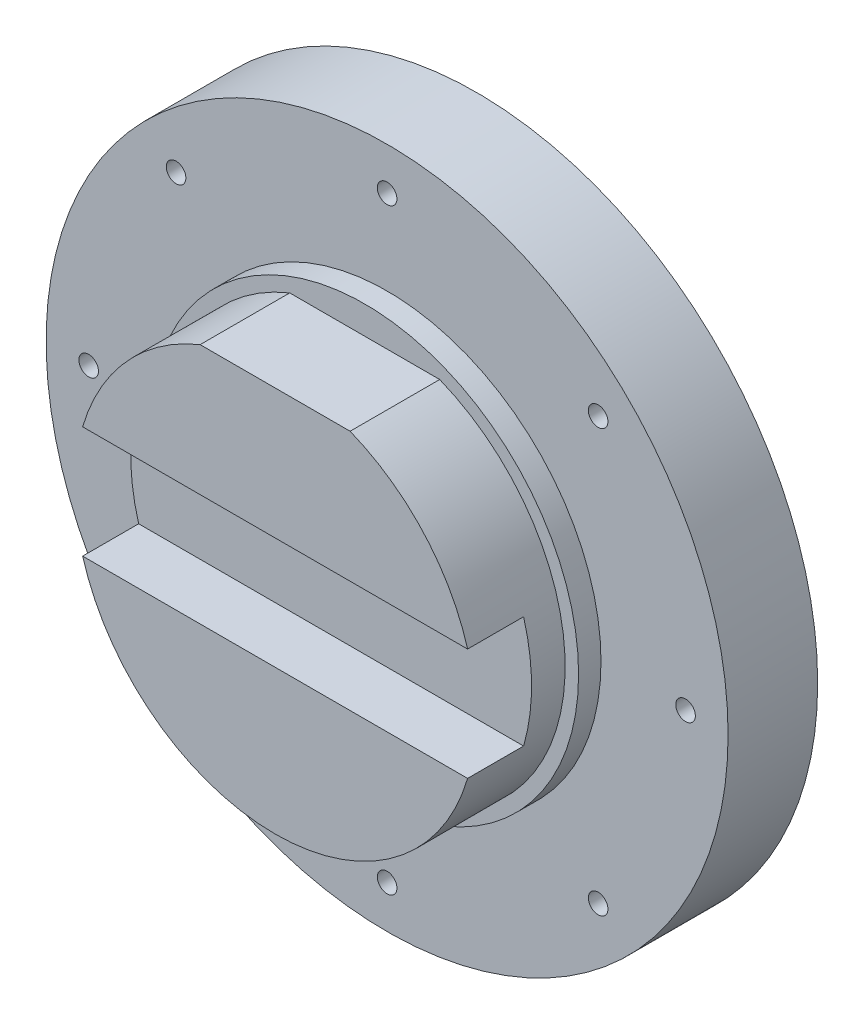
ISO-10303-21;
HEADER;
FILE_DESCRIPTION(('STEP AP214'),'2;1');
FILE_NAME('part.step','',(''),(''),'','','');
FILE_SCHEMA(('AUTOMOTIVE_DESIGN { 1 0 10303 214 1 1 1 1 }'));
ENDSEC;
DATA;
#1=APPLICATION_CONTEXT('core data for automotive mechanical design processes');
#2=APPLICATION_PROTOCOL_DEFINITION('international standard','automotive_design',2000,#1);
#3=PRODUCT_CONTEXT('',#1,'mechanical');
#4=PRODUCT('Part','Part','',(#3));
#5=PRODUCT_RELATED_PRODUCT_CATEGORY('part','',(#4));
#6=PRODUCT_DEFINITION_FORMATION('','',#4);
#7=PRODUCT_DEFINITION_CONTEXT('part definition',#1,'design');
#8=PRODUCT_DEFINITION('design','',#6,#7);
#9=PRODUCT_DEFINITION_SHAPE('','',#8);
#10=(LENGTH_UNIT() NAMED_UNIT(*) SI_UNIT(.MILLI.,.METRE.));
#11=(NAMED_UNIT(*) PLANE_ANGLE_UNIT() SI_UNIT($,.RADIAN.));
#12=(NAMED_UNIT(*) SI_UNIT($,.STERADIAN.) SOLID_ANGLE_UNIT());
#13=UNCERTAINTY_MEASURE_WITH_UNIT(LENGTH_MEASURE(1.E-05),#10,'distance_accuracy_value','');
#14=(GEOMETRIC_REPRESENTATION_CONTEXT(3) GLOBAL_UNCERTAINTY_ASSIGNED_CONTEXT((#13)) GLOBAL_UNIT_ASSIGNED_CONTEXT((#10,
#11,#12)) REPRESENTATION_CONTEXT('',''));
#15=CARTESIAN_POINT('',(0.,0.,0.));
#16=DIRECTION('',(0.,0.,1.));
#17=DIRECTION('',(1.,0.,0.));
#18=AXIS2_PLACEMENT_3D('',#15,#16,#17);
#19=CARTESIAN_POINT('',(0.,0.,180.));
#20=DIRECTION('',(0.,0.,1.));
#21=DIRECTION('',(1.,0.,0.));
#22=AXIS2_PLACEMENT_3D('',#19,#20,#21);
#23=PLANE('',#22);
#24=DIRECTION('',(1.,0.,0.));
#25=VECTOR('',#24,1.);
#26=CARTESIAN_POINT('',(0.,-50.,180.));
#27=LINE('',#26,#25);
#28=CARTESIAN_POINT('',(-171.874954545449,-50.,180.));
#29=VERTEX_POINT('',#28);
#30=CARTESIAN_POINT('',(171.874954545448,-50.,180.));
#31=VERTEX_POINT('',#30);
#32=EDGE_CURVE('E135',#29,#31,#27,.T.);
#33=ORIENTED_EDGE('',*,*,#32,.F.);
#34=CARTESIAN_POINT('',(0.,0.,180.));
#35=DIRECTION('',(0.,0.,1.));
#36=DIRECTION('',(1.,0.,0.));
#37=AXIS2_PLACEMENT_3D('',#34,#35,#36);
#38=CIRCLE('',#37,179.);
#39=EDGE_CURVE('E166',#29,#31,#38,.T.);
#40=ORIENTED_EDGE('',*,*,#39,.T.);
#41=EDGE_LOOP('',(#33,#40));
#42=FACE_BOUND('',#41,.T.);
#43=ADVANCED_FACE('F70',(#42),#23,.T.);
#44=CARTESIAN_POINT('',(0.,0.,180.));
#45=DIRECTION('',(0.,0.,-1.));
#46=DIRECTION('',(-1.,0.,0.));
#47=AXIS2_PLACEMENT_3D('',#44,#45,#46);
#48=CYLINDRICAL_SURFACE('',#47,179.);
#49=ORIENTED_EDGE('',*,*,#39,.F.);
#50=DIRECTION('',(0.,0.,-1.));
#51=VECTOR('',#50,1.);
#52=CARTESIAN_POINT('',(-171.874954545449,-50.,180.));
#53=LINE('',#52,#51);
#54=CARTESIAN_POINT('',(-171.874954545449,-50.,130.));
#55=VERTEX_POINT('',#54);
#56=EDGE_CURVE('E125',#29,#55,#53,.T.);
#57=ORIENTED_EDGE('',*,*,#56,.T.);
#58=CARTESIAN_POINT('',(0.,0.,130.));
#59=DIRECTION('',(0.,0.,1.));
#60=DIRECTION('',(1.,0.,0.));
#61=AXIS2_PLACEMENT_3D('',#58,#59,#60);
#62=CIRCLE('',#61,179.);
#63=CARTESIAN_POINT('',(-171.874954545449,50.,130.));
#64=VERTEX_POINT('',#63);
#65=EDGE_CURVE('E13',#64,#55,#62,.T.);
#66=ORIENTED_EDGE('',*,*,#65,.F.);
#67=DIRECTION('',(0.,0.,-1.));
#68=VECTOR('',#67,1.);
#69=CARTESIAN_POINT('',(-171.874954545449,50.,180.));
#70=LINE('',#69,#68);
#71=CARTESIAN_POINT('',(-171.874954545449,50.,180.));
#72=VERTEX_POINT('',#71);
#73=EDGE_CURVE('E159',#64,#72,#70,.F.);
#74=ORIENTED_EDGE('',*,*,#73,.T.);
#75=CARTESIAN_POINT('',(-66.9701426010129,166.,180.));
#76=VERTEX_POINT('',#75);
#77=EDGE_CURVE('E122',#76,#72,#38,.T.);
#78=ORIENTED_EDGE('',*,*,#77,.F.);
#79=DIRECTION('',(0.,0.,-1.));
#80=VECTOR('',#79,1.);
#81=CARTESIAN_POINT('',(-66.9701426010129,166.,180.));
#82=LINE('',#81,#80);
#83=CARTESIAN_POINT('',(-66.9701426010129,166.,100.));
#84=VERTEX_POINT('',#83);
#85=EDGE_CURVE('E109',#76,#84,#82,.T.);
#86=ORIENTED_EDGE('',*,*,#85,.T.);
#87=CARTESIAN_POINT('',(0.,0.,100.));
#88=DIRECTION('',(0.,0.,1.));
#89=DIRECTION('',(1.,0.,0.));
#90=AXIS2_PLACEMENT_3D('',#87,#88,#89);
#91=CIRCLE('',#90,179.);
#92=CARTESIAN_POINT('',(66.9701426010129,166.,100.));
#93=VERTEX_POINT('',#92);
#94=EDGE_CURVE('E117',#84,#93,#91,.T.);
#95=ORIENTED_EDGE('',*,*,#94,.T.);
#96=DIRECTION('',(0.,0.,-1.));
#97=VECTOR('',#96,1.);
#98=CARTESIAN_POINT('',(66.9701426010129,166.,180.));
#99=LINE('',#98,#97);
#100=CARTESIAN_POINT('',(66.9701426010129,166.,180.));
#101=VERTEX_POINT('',#100);
#102=EDGE_CURVE('E112',#101,#93,#99,.T.);
#103=ORIENTED_EDGE('',*,*,#102,.F.);
#104=CARTESIAN_POINT('',(171.874954545449,50.,180.));
#105=VERTEX_POINT('',#104);
#106=EDGE_CURVE('E116',#105,#101,#38,.T.);
#107=ORIENTED_EDGE('',*,*,#106,.F.);
#108=DIRECTION('',(0.,0.,-1.));
#109=VECTOR('',#108,1.);
#110=CARTESIAN_POINT('',(171.874954545449,50.,180.));
#111=LINE('',#110,#109);
#112=CARTESIAN_POINT('',(171.874954545449,50.,130.));
#113=VERTEX_POINT('',#112);
#114=EDGE_CURVE('E85',#105,#113,#111,.T.);
#115=ORIENTED_EDGE('',*,*,#114,.T.);
#116=CARTESIAN_POINT('',(171.874954545449,-50.,130.));
#117=VERTEX_POINT('',#116);
#118=EDGE_CURVE('E74',#117,#113,#62,.T.);
#119=ORIENTED_EDGE('',*,*,#118,.F.);
#120=DIRECTION('',(0.,0.,-1.));
#121=VECTOR('',#120,1.);
#122=CARTESIAN_POINT('',(171.874954545449,-50.,180.));
#123=LINE('',#122,#121);
#124=EDGE_CURVE('E128',#117,#31,#123,.F.);
#125=ORIENTED_EDGE('',*,*,#124,.T.);
#126=EDGE_LOOP('',(#49,#57,#66,#74,#78,#86,#95,#103,#107,#115,#119,#125));
#127=FACE_BOUND('',#126,.T.);
#128=ADVANCED_FACE('F72',(#127),#48,.T.);
#129=CARTESIAN_POINT('',(-66.9701426010129,166.,180.));
#130=DIRECTION('',(0.,-1.,0.));
#131=DIRECTION('',(0.,0.,-1.));
#132=AXIS2_PLACEMENT_3D('',#129,#130,#131);
#133=PLANE('',#132);
#134=DIRECTION('',(-1.,0.,0.));
#135=VECTOR('',#134,1.);
#136=CARTESIAN_POINT('',(-66.9701426010129,166.,100.));
#137=LINE('',#136,#135);
#138=EDGE_CURVE('E106',#93,#84,#137,.T.);
#139=ORIENTED_EDGE('',*,*,#138,.T.);
#140=ORIENTED_EDGE('',*,*,#85,.F.);
#141=DIRECTION('',(-1.,0.,0.));
#142=VECTOR('',#141,1.);
#143=CARTESIAN_POINT('',(-66.9701426010129,166.,180.));
#144=LINE('',#143,#142);
#145=EDGE_CURVE('E94',#101,#76,#144,.T.);
#146=ORIENTED_EDGE('',*,*,#145,.F.);
#147=ORIENTED_EDGE('',*,*,#102,.T.);
#148=EDGE_LOOP('',(#139,#140,#146,#147));
#149=FACE_BOUND('',#148,.T.);
#150=ADVANCED_FACE('F108',(#149),#133,.F.);
#151=DIRECTION('',(-1.,0.,0.));
#152=VECTOR('',#151,1.);
#153=CARTESIAN_POINT('',(0.,50.,180.));
#154=LINE('',#153,#152);
#155=EDGE_CURVE('E134',#105,#72,#154,.T.);
#156=ORIENTED_EDGE('',*,*,#155,.F.);
#157=ORIENTED_EDGE('',*,*,#106,.T.);
#158=ORIENTED_EDGE('',*,*,#145,.T.);
#159=ORIENTED_EDGE('',*,*,#77,.T.);
#160=EDGE_LOOP('',(#156,#157,#158,#159));
#161=FACE_BOUND('',#160,.T.);
#162=ADVANCED_FACE('F168',(#161),#23,.T.);
#163=CARTESIAN_POINT('',(0.,0.,100.));
#164=DIRECTION('',(0.,0.,1.));
#165=DIRECTION('',(1.,0.,0.));
#166=AXIS2_PLACEMENT_3D('',#163,#164,#165);
#167=PLANE('',#166);
#168=ORIENTED_EDGE('',*,*,#94,.F.);
#169=ORIENTED_EDGE('',*,*,#138,.F.);
#170=EDGE_LOOP('',(#168,#169));
#171=FACE_BOUND('',#170,.T.);
#172=ADVANCED_FACE('F124',(#171),#167,.F.);
#173=CARTESIAN_POINT('',(0.,0.,130.));
#174=DIRECTION('',(0.,0.,1.));
#175=DIRECTION('',(1.,0.,0.));
#176=AXIS2_PLACEMENT_3D('',#173,#174,#175);
#177=PLANE('',#176);
#178=ORIENTED_EDGE('',*,*,#65,.T.);
#179=DIRECTION('',(1.,0.,0.));
#180=VECTOR('',#179,1.);
#181=CARTESIAN_POINT('',(-184.339360962329,-50.,130.));
#182=LINE('',#181,#180);
#183=EDGE_CURVE('E154',#55,#117,#182,.T.);
#184=ORIENTED_EDGE('',*,*,#183,.T.);
#185=ORIENTED_EDGE('',*,*,#118,.T.);
#186=DIRECTION('',(-1.,0.,0.));
#187=VECTOR('',#186,1.);
#188=CARTESIAN_POINT('',(-184.339360962329,50.,130.));
#189=LINE('',#188,#187);
#190=EDGE_CURVE('E151',#113,#64,#189,.T.);
#191=ORIENTED_EDGE('',*,*,#190,.T.);
#192=EDGE_LOOP('',(#178,#184,#185,#191));
#193=FACE_BOUND('',#192,.T.);
#194=ADVANCED_FACE('F149',(#193),#177,.T.);
#195=CARTESIAN_POINT('',(-184.339360962329,-50.,130.));
#196=DIRECTION('',(0.,-1.,0.));
#197=DIRECTION('',(0.,0.,-1.));
#198=AXIS2_PLACEMENT_3D('',#195,#196,#197);
#199=PLANE('',#198);
#200=ORIENTED_EDGE('',*,*,#32,.T.);
#201=ORIENTED_EDGE('',*,*,#124,.F.);
#202=ORIENTED_EDGE('',*,*,#183,.F.);
#203=ORIENTED_EDGE('',*,*,#56,.F.);
#204=EDGE_LOOP('',(#200,#201,#202,#203));
#205=FACE_BOUND('',#204,.T.);
#206=ADVANCED_FACE('F174',(#205),#199,.F.);
#207=CARTESIAN_POINT('',(-184.339360962329,50.,130.));
#208=DIRECTION('',(0.,1.,0.));
#209=DIRECTION('',(0.,0.,1.));
#210=AXIS2_PLACEMENT_3D('',#207,#208,#209);
#211=PLANE('',#210);
#212=ORIENTED_EDGE('',*,*,#155,.T.);
#213=ORIENTED_EDGE('',*,*,#73,.F.);
#214=ORIENTED_EDGE('',*,*,#190,.F.);
#215=ORIENTED_EDGE('',*,*,#114,.F.);
#216=EDGE_LOOP('',(#212,#213,#214,#215));
#217=FACE_BOUND('',#216,.T.);
#218=ADVANCED_FACE('F158',(#217),#211,.F.);
#219=CLOSED_SHELL('',(#43,#128,#150,#162,#172,#194,#206,#218));
#220=MANIFOLD_SOLID_BREP('B2',#219);
#221=CARTESIAN_POINT('',(0.,0.,100.));
#222=DIRECTION('',(0.,0.,-1.));
#223=DIRECTION('',(-1.,0.,0.));
#224=AXIS2_PLACEMENT_3D('',#221,#222,#223);
#225=CYLINDRICAL_SURFACE('',#224,179.);
#226=CARTESIAN_POINT('',(0.,0.,80.));
#227=DIRECTION('',(0.,0.,1.));
#228=DIRECTION('',(1.,0.,0.));
#229=AXIS2_PLACEMENT_3D('',#226,#227,#228);
#230=CIRCLE('',#229,179.);
#231=CARTESIAN_POINT('',(-66.9701426010129,166.,80.));
#232=VERTEX_POINT('',#231);
#233=CARTESIAN_POINT('',(66.9701426010129,166.,80.));
#234=VERTEX_POINT('',#233);
#235=EDGE_CURVE('E277',#232,#234,#230,.T.);
#236=ORIENTED_EDGE('',*,*,#235,.F.);
#237=DIRECTION('',(0.,0.,-1.));
#238=VECTOR('',#237,1.);
#239=CARTESIAN_POINT('',(-66.9701426010129,166.,100.));
#240=LINE('',#239,#238);
#241=CARTESIAN_POINT('',(-66.9701426010129,166.,100.));
#242=VERTEX_POINT('',#241);
#243=EDGE_CURVE('E68',#242,#232,#240,.T.);
#244=ORIENTED_EDGE('',*,*,#243,.F.);
#245=CARTESIAN_POINT('',(0.,0.,100.));
#246=DIRECTION('',(0.,0.,1.));
#247=DIRECTION('',(1.,0.,0.));
#248=AXIS2_PLACEMENT_3D('',#245,#246,#247);
#249=CIRCLE('',#248,179.);
#250=CARTESIAN_POINT('',(66.9701426010129,166.,100.));
#251=VERTEX_POINT('',#250);
#252=EDGE_CURVE('E278',#242,#251,#249,.T.);
#253=ORIENTED_EDGE('',*,*,#252,.T.);
#254=DIRECTION('',(0.,0.,-1.));
#255=VECTOR('',#254,1.);
#256=CARTESIAN_POINT('',(66.9701426010129,166.,100.));
#257=LINE('',#256,#255);
#258=EDGE_CURVE('E257',#251,#234,#257,.T.);
#259=ORIENTED_EDGE('',*,*,#258,.T.);
#260=EDGE_LOOP('',(#236,#244,#253,#259));
#261=FACE_BOUND('',#260,.T.);
#262=ADVANCED_FACE('F249',(#261),#225,.F.);
#263=CARTESIAN_POINT('',(0.,166.,100.));
#264=DIRECTION('',(0.,1.,0.));
#265=DIRECTION('',(0.,0.,1.));
#266=AXIS2_PLACEMENT_3D('',#263,#264,#265);
#267=PLANE('',#266);
#268=DIRECTION('',(1.,0.,0.));
#269=VECTOR('',#268,1.);
#270=CARTESIAN_POINT('',(0.,166.,80.));
#271=LINE('',#270,#269);
#272=EDGE_CURVE('E280',#232,#234,#271,.T.);
#273=ORIENTED_EDGE('',*,*,#272,.T.);
#274=ORIENTED_EDGE('',*,*,#258,.F.);
#275=DIRECTION('',(1.,0.,0.));
#276=VECTOR('',#275,1.);
#277=CARTESIAN_POINT('',(0.,166.,100.));
#278=LINE('',#277,#276);
#279=EDGE_CURVE('E264',#242,#251,#278,.T.);
#280=ORIENTED_EDGE('',*,*,#279,.F.);
#281=ORIENTED_EDGE('',*,*,#243,.T.);
#282=EDGE_LOOP('',(#273,#274,#280,#281));
#283=FACE_BOUND('',#282,.T.);
#284=ADVANCED_FACE('F281',(#283),#267,.F.);
#285=CARTESIAN_POINT('',(0.,0.,100.));
#286=DIRECTION('',(0.,0.,-1.));
#287=DIRECTION('',(-1.,0.,0.));
#288=AXIS2_PLACEMENT_3D('',#285,#286,#287);
#289=CYLINDRICAL_SURFACE('',#288,191.);
#290=CARTESIAN_POINT('',(0.,0.,100.));
#291=DIRECTION('',(0.,0.,1.));
#292=DIRECTION('',(1.,0.,0.));
#293=AXIS2_PLACEMENT_3D('',#290,#291,#292);
#294=CIRCLE('',#293,191.);
#295=CARTESIAN_POINT('',(191.,0.,100.));
#296=VERTEX_POINT('',#295);
#297=EDGE_CURVE('E279',#296,#296,#294,.F.);
#298=ORIENTED_EDGE('',*,*,#297,.T.);
#299=EDGE_LOOP('',(#298));
#300=FACE_BOUND('',#299,.T.);
#301=CARTESIAN_POINT('',(0.,0.,80.));
#302=DIRECTION('',(0.,0.,1.));
#303=DIRECTION('',(1.,0.,0.));
#304=AXIS2_PLACEMENT_3D('',#301,#302,#303);
#305=CIRCLE('',#304,191.);
#306=CARTESIAN_POINT('',(191.,0.,80.));
#307=VERTEX_POINT('',#306);
#308=EDGE_CURVE('E283',#307,#307,#305,.F.);
#309=ORIENTED_EDGE('',*,*,#308,.F.);
#310=EDGE_LOOP('',(#309));
#311=FACE_BOUND('',#310,.T.);
#312=ADVANCED_FACE('F297',(#300,#311),#289,.T.);
#313=CARTESIAN_POINT('',(0.,0.,100.));
#314=DIRECTION('',(0.,0.,1.));
#315=DIRECTION('',(1.,0.,0.));
#316=AXIS2_PLACEMENT_3D('',#313,#314,#315);
#317=PLANE('',#316);
#318=ORIENTED_EDGE('',*,*,#252,.F.);
#319=ORIENTED_EDGE('',*,*,#279,.T.);
#320=EDGE_LOOP('',(#318,#319));
#321=FACE_BOUND('',#320,.T.);
#322=ORIENTED_EDGE('',*,*,#297,.F.);
#323=EDGE_LOOP('',(#322));
#324=FACE_BOUND('',#323,.T.);
#325=ADVANCED_FACE('F300',(#321,#324),#317,.T.);
#326=CARTESIAN_POINT('',(0.,0.,80.));
#327=DIRECTION('',(0.,0.,1.));
#328=DIRECTION('',(1.,0.,0.));
#329=AXIS2_PLACEMENT_3D('',#326,#327,#328);
#330=PLANE('',#329);
#331=ORIENTED_EDGE('',*,*,#235,.T.);
#332=ORIENTED_EDGE('',*,*,#272,.F.);
#333=EDGE_LOOP('',(#331,#332));
#334=FACE_BOUND('',#333,.T.);
#335=ORIENTED_EDGE('',*,*,#308,.T.);
#336=EDGE_LOOP('',(#335));
#337=FACE_BOUND('',#336,.T.);
#338=ADVANCED_FACE('F285',(#334,#337),#330,.F.);
#339=CLOSED_SHELL('',(#262,#284,#312,#325,#338));
#340=MANIFOLD_SOLID_BREP('B7',#339);
#341=CARTESIAN_POINT('',(0.,0.,80.));
#342=DIRECTION('',(0.,0.,1.));
#343=DIRECTION('',(1.,0.,0.));
#344=AXIS2_PLACEMENT_3D('',#341,#342,#343);
#345=PLANE('',#344);
#346=CARTESIAN_POINT('',(188.44171883269,188.446195513153,80.));
#347=DIRECTION('',(0.,0.,1.));
#348=DIRECTION('',(1.,0.,0.));
#349=AXIS2_PLACEMENT_3D('',#346,#347,#348);
#350=CIRCLE('',#349,8.75);
#351=CARTESIAN_POINT('',(197.19171883269,188.446195513153,80.));
#352=VERTEX_POINT('',#351);
#353=EDGE_CURVE('E346',#352,#352,#350,.F.);
#354=ORIENTED_EDGE('',*,*,#353,.T.);
#355=EDGE_LOOP('',(#354));
#356=FACE_BOUND('',#355,.T.);
#357=CARTESIAN_POINT('',(188.44171883269,-188.446195513153,80.));
#358=DIRECTION('',(0.,0.,1.));
#359=DIRECTION('',(1.,0.,0.));
#360=AXIS2_PLACEMENT_3D('',#357,#358,#359);
#361=CIRCLE('',#360,8.75);
#362=CARTESIAN_POINT('',(197.19171883269,-188.446195513153,80.));
#363=VERTEX_POINT('',#362);
#364=EDGE_CURVE('E372',#363,#363,#361,.F.);
#365=ORIENTED_EDGE('',*,*,#364,.T.);
#366=EDGE_LOOP('',(#365));
#367=FACE_BOUND('',#366,.T.);
#368=CARTESIAN_POINT('',(266.5,0.,80.));
#369=DIRECTION('',(0.,0.,1.));
#370=DIRECTION('',(1.,0.,0.));
#371=AXIS2_PLACEMENT_3D('',#368,#369,#370);
#372=CIRCLE('',#371,8.74999999999997);
#373=CARTESIAN_POINT('',(275.25,0.,80.));
#374=VERTEX_POINT('',#373);
#375=EDGE_CURVE('E368',#374,#374,#372,.F.);
#376=ORIENTED_EDGE('',*,*,#375,.T.);
#377=EDGE_LOOP('',(#376));
#378=FACE_BOUND('',#377,.T.);
#379=CARTESIAN_POINT('',(0.,0.,80.));
#380=DIRECTION('',(0.,0.,1.));
#381=DIRECTION('',(1.,0.,0.));
#382=AXIS2_PLACEMENT_3D('',#379,#380,#381);
#383=CIRCLE('',#382,304.5);
#384=CARTESIAN_POINT('',(304.5,0.,80.));
#385=VERTEX_POINT('',#384);
#386=EDGE_CURVE('E351',#385,#385,#383,.T.);
#387=ORIENTED_EDGE('',*,*,#386,.T.);
#388=EDGE_LOOP('',(#387));
#389=FACE_BOUND('',#388,.T.);
#390=CARTESIAN_POINT('',(0.,0.,80.));
#391=DIRECTION('',(0.,0.,1.));
#392=DIRECTION('',(1.,0.,0.));
#393=AXIS2_PLACEMENT_3D('',#390,#391,#392);
#394=CIRCLE('',#393,191.);
#395=CARTESIAN_POINT('',(191.,0.,80.));
#396=VERTEX_POINT('',#395);
#397=EDGE_CURVE('E248',#396,#396,#394,.T.);
#398=ORIENTED_EDGE('',*,*,#397,.F.);
#399=EDGE_LOOP('',(#398));
#400=FACE_BOUND('',#399,.T.);
#401=CARTESIAN_POINT('',(0.,-266.5,80.));
#402=DIRECTION('',(0.,0.,1.));
#403=DIRECTION('',(1.,0.,0.));
#404=AXIS2_PLACEMENT_3D('',#401,#402,#403);
#405=CIRCLE('',#404,8.75);
#406=CARTESIAN_POINT('',(8.75,-266.5,80.));
#407=VERTEX_POINT('',#406);
#408=EDGE_CURVE('E377',#407,#407,#405,.T.);
#409=ORIENTED_EDGE('',*,*,#408,.F.);
#410=EDGE_LOOP('',(#409));
#411=FACE_BOUND('',#410,.T.);
#412=CARTESIAN_POINT('',(-188.44171883269,-188.446195513153,80.));
#413=DIRECTION('',(0.,0.,1.));
#414=DIRECTION('',(1.,0.,0.));
#415=AXIS2_PLACEMENT_3D('',#412,#413,#414);
#416=CIRCLE('',#415,8.75);
#417=CARTESIAN_POINT('',(-179.69171883269,-188.446195513153,80.));
#418=VERTEX_POINT('',#417);
#419=EDGE_CURVE('E381',#418,#418,#416,.T.);
#420=ORIENTED_EDGE('',*,*,#419,.F.);
#421=EDGE_LOOP('',(#420));
#422=FACE_BOUND('',#421,.T.);
#423=CARTESIAN_POINT('',(-266.5,0.,80.));
#424=DIRECTION('',(0.,0.,1.));
#425=DIRECTION('',(1.,0.,0.));
#426=AXIS2_PLACEMENT_3D('',#423,#424,#425);
#427=CIRCLE('',#426,8.74999999999997);
#428=CARTESIAN_POINT('',(-257.75,0.,80.));
#429=VERTEX_POINT('',#428);
#430=EDGE_CURVE('E385',#429,#429,#427,.T.);
#431=ORIENTED_EDGE('',*,*,#430,.F.);
#432=EDGE_LOOP('',(#431));
#433=FACE_BOUND('',#432,.T.);
#434=CARTESIAN_POINT('',(-188.44171883269,188.446195513153,80.));
#435=DIRECTION('',(0.,0.,1.));
#436=DIRECTION('',(1.,0.,0.));
#437=AXIS2_PLACEMENT_3D('',#434,#435,#436);
#438=CIRCLE('',#437,8.75);
#439=CARTESIAN_POINT('',(-179.69171883269,188.446195513153,80.));
#440=VERTEX_POINT('',#439);
#441=EDGE_CURVE('E389',#440,#440,#438,.T.);
#442=ORIENTED_EDGE('',*,*,#441,.F.);
#443=EDGE_LOOP('',(#442));
#444=FACE_BOUND('',#443,.T.);
#445=CARTESIAN_POINT('',(0.,266.5,80.));
#446=DIRECTION('',(0.,0.,1.));
#447=DIRECTION('',(1.,0.,0.));
#448=AXIS2_PLACEMENT_3D('',#445,#446,#447);
#449=CIRCLE('',#448,8.75);
#450=CARTESIAN_POINT('',(8.75,266.5,80.));
#451=VERTEX_POINT('',#450);
#452=EDGE_CURVE('E392',#451,#451,#449,.T.);
#453=ORIENTED_EDGE('',*,*,#452,.F.);
#454=EDGE_LOOP('',(#453));
#455=FACE_BOUND('',#454,.T.);
#456=ADVANCED_FACE('F342',(#356,#367,#378,#389,#400,#411,#422,#433,#444,#455),#345,.T.);
#457=CARTESIAN_POINT('',(0.,0.,80.));
#458=DIRECTION('',(0.,0.,-1.));
#459=DIRECTION('',(-1.,0.,0.));
#460=AXIS2_PLACEMENT_3D('',#457,#458,#459);
#461=CYLINDRICAL_SURFACE('',#460,191.);
#462=ORIENTED_EDGE('',*,*,#397,.T.);
#463=EDGE_LOOP('',(#462));
#464=FACE_BOUND('',#463,.T.);
#465=CARTESIAN_POINT('',(0.,0.,0.));
#466=DIRECTION('',(0.,0.,1.));
#467=DIRECTION('',(1.,0.,0.));
#468=AXIS2_PLACEMENT_3D('',#465,#466,#467);
#469=CIRCLE('',#468,191.);
#470=CARTESIAN_POINT('',(191.,0.,0.));
#471=VERTEX_POINT('',#470);
#472=EDGE_CURVE('E357',#471,#471,#469,.T.);
#473=ORIENTED_EDGE('',*,*,#472,.F.);
#474=EDGE_LOOP('',(#473));
#475=FACE_BOUND('',#474,.T.);
#476=ADVANCED_FACE('F460',(#464,#475),#461,.F.);
#477=CARTESIAN_POINT('',(0.,0.,0.));
#478=DIRECTION('',(0.,0.,1.));
#479=DIRECTION('',(1.,0.,0.));
#480=AXIS2_PLACEMENT_3D('',#477,#478,#479);
#481=PLANE('',#480);
#482=CARTESIAN_POINT('',(0.,0.,0.));
#483=DIRECTION('',(0.,0.,1.));
#484=DIRECTION('',(1.,0.,0.));
#485=AXIS2_PLACEMENT_3D('',#482,#483,#484);
#486=CIRCLE('',#485,304.5);
#487=CARTESIAN_POINT('',(304.5,0.,0.));
#488=VERTEX_POINT('',#487);
#489=EDGE_CURVE('E361',#488,#488,#486,.T.);
#490=ORIENTED_EDGE('',*,*,#489,.F.);
#491=EDGE_LOOP('',(#490));
#492=FACE_BOUND('',#491,.T.);
#493=ORIENTED_EDGE('',*,*,#472,.T.);
#494=EDGE_LOOP('',(#493));
#495=FACE_BOUND('',#494,.T.);
#496=ADVANCED_FACE('F461',(#492,#495),#481,.F.);
#497=CARTESIAN_POINT('',(0.,0.,80.));
#498=DIRECTION('',(0.,0.,-1.));
#499=DIRECTION('',(-1.,0.,0.));
#500=AXIS2_PLACEMENT_3D('',#497,#498,#499);
#501=CYLINDRICAL_SURFACE('',#500,304.5);
#502=ORIENTED_EDGE('',*,*,#386,.F.);
#503=EDGE_LOOP('',(#502));
#504=FACE_BOUND('',#503,.T.);
#505=ORIENTED_EDGE('',*,*,#489,.T.);
#506=EDGE_LOOP('',(#505));
#507=FACE_BOUND('',#506,.T.);
#508=ADVANCED_FACE('F344',(#504,#507),#501,.T.);
#509=CARTESIAN_POINT('',(266.5,0.,50.));
#510=DIRECTION('',(0.,0.,1.));
#511=DIRECTION('',(1.,0.,0.));
#512=AXIS2_PLACEMENT_3D('',#509,#510,#511);
#513=CYLINDRICAL_SURFACE('',#512,8.74999999999997);
#514=ORIENTED_EDGE('',*,*,#375,.F.);
#515=EDGE_LOOP('',(#514));
#516=FACE_BOUND('',#515,.T.);
#517=CARTESIAN_POINT('',(266.5,0.,50.));
#518=DIRECTION('',(0.,0.,-1.));
#519=DIRECTION('',(-1.,0.,0.));
#520=AXIS2_PLACEMENT_3D('',#517,#518,#519);
#521=CIRCLE('',#520,8.74999999999997);
#522=CARTESIAN_POINT('',(257.75,0.,50.));
#523=VERTEX_POINT('',#522);
#524=EDGE_CURVE('E438',#523,#523,#521,.T.);
#525=ORIENTED_EDGE('',*,*,#524,.T.);
#526=EDGE_LOOP('',(#525));
#527=FACE_BOUND('',#526,.T.);
#528=ADVANCED_FACE('F443',(#516,#527),#513,.F.);
#529=CARTESIAN_POINT('',(266.5,0.,50.));
#530=DIRECTION('',(0.,0.,-1.));
#531=DIRECTION('',(-1.,0.,0.));
#532=AXIS2_PLACEMENT_3D('',#529,#530,#531);
#533=PLANE('',#532);
#534=ORIENTED_EDGE('',*,*,#524,.F.);
#535=EDGE_LOOP('',(#534));
#536=FACE_BOUND('',#535,.T.);
#537=ADVANCED_FACE('F445',(#536),#533,.F.);
#538=CARTESIAN_POINT('',(188.44171883269,-188.446195513153,50.));
#539=DIRECTION('',(0.,0.,1.));
#540=DIRECTION('',(1.,0.,0.));
#541=AXIS2_PLACEMENT_3D('',#538,#539,#540);
#542=CYLINDRICAL_SURFACE('',#541,8.75);
#543=ORIENTED_EDGE('',*,*,#364,.F.);
#544=EDGE_LOOP('',(#543));
#545=FACE_BOUND('',#544,.T.);
#546=CARTESIAN_POINT('',(188.44171883269,-188.446195513153,50.));
#547=DIRECTION('',(0.,0.,-1.));
#548=DIRECTION('',(-1.,0.,0.));
#549=AXIS2_PLACEMENT_3D('',#546,#547,#548);
#550=CIRCLE('',#549,8.75);
#551=CARTESIAN_POINT('',(179.69171883269,-188.446195513153,50.));
#552=VERTEX_POINT('',#551);
#553=EDGE_CURVE('E435',#552,#552,#550,.T.);
#554=ORIENTED_EDGE('',*,*,#553,.T.);
#555=EDGE_LOOP('',(#554));
#556=FACE_BOUND('',#555,.T.);
#557=ADVANCED_FACE('F447',(#545,#556),#542,.F.);
#558=CARTESIAN_POINT('',(188.44171883269,-188.446195513153,50.));
#559=DIRECTION('',(0.,0.,-1.));
#560=DIRECTION('',(-1.,0.,0.));
#561=AXIS2_PLACEMENT_3D('',#558,#559,#560);
#562=PLANE('',#561);
#563=ORIENTED_EDGE('',*,*,#553,.F.);
#564=EDGE_LOOP('',(#563));
#565=FACE_BOUND('',#564,.T.);
#566=ADVANCED_FACE('F453',(#565),#562,.F.);
#567=CARTESIAN_POINT('',(0.,-266.5,50.));
#568=DIRECTION('',(0.,0.,1.));
#569=DIRECTION('',(1.,0.,0.));
#570=AXIS2_PLACEMENT_3D('',#567,#568,#569);
#571=CYLINDRICAL_SURFACE('',#570,8.75);
#572=ORIENTED_EDGE('',*,*,#408,.T.);
#573=EDGE_LOOP('',(#572));
#574=FACE_BOUND('',#573,.T.);
#575=CARTESIAN_POINT('',(0.,-266.5,50.));
#576=DIRECTION('',(0.,0.,1.));
#577=DIRECTION('',(1.,0.,0.));
#578=AXIS2_PLACEMENT_3D('',#575,#576,#577);
#579=CIRCLE('',#578,8.75);
#580=CARTESIAN_POINT('',(8.75,-266.5,50.));
#581=VERTEX_POINT('',#580);
#582=EDGE_CURVE('E431',#581,#581,#579,.T.);
#583=ORIENTED_EDGE('',*,*,#582,.F.);
#584=EDGE_LOOP('',(#583));
#585=FACE_BOUND('',#584,.T.);
#586=ADVANCED_FACE('F525',(#574,#585),#571,.F.);
#587=CARTESIAN_POINT('',(0.,-266.5,50.));
#588=DIRECTION('',(0.,0.,1.));
#589=DIRECTION('',(1.,0.,0.));
#590=AXIS2_PLACEMENT_3D('',#587,#588,#589);
#591=PLANE('',#590);
#592=ORIENTED_EDGE('',*,*,#582,.T.);
#593=EDGE_LOOP('',(#592));
#594=FACE_BOUND('',#593,.T.);
#595=ADVANCED_FACE('F520',(#594),#591,.T.);
#596=CARTESIAN_POINT('',(-188.44171883269,-188.446195513153,50.));
#597=DIRECTION('',(0.,0.,1.));
#598=DIRECTION('',(1.,0.,0.));
#599=AXIS2_PLACEMENT_3D('',#596,#597,#598);
#600=CYLINDRICAL_SURFACE('',#599,8.75);
#601=ORIENTED_EDGE('',*,*,#419,.T.);
#602=EDGE_LOOP('',(#601));
#603=FACE_BOUND('',#602,.T.);
#604=CARTESIAN_POINT('',(-188.44171883269,-188.446195513153,50.));
#605=DIRECTION('',(0.,0.,1.));
#606=DIRECTION('',(1.,0.,0.));
#607=AXIS2_PLACEMENT_3D('',#604,#605,#606);
#608=CIRCLE('',#607,8.75);
#609=CARTESIAN_POINT('',(-179.69171883269,-188.446195513153,50.));
#610=VERTEX_POINT('',#609);
#611=EDGE_CURVE('E427',#610,#610,#608,.T.);
#612=ORIENTED_EDGE('',*,*,#611,.F.);
#613=EDGE_LOOP('',(#612));
#614=FACE_BOUND('',#613,.T.);
#615=ADVANCED_FACE('F517',(#603,#614),#600,.F.);
#616=CARTESIAN_POINT('',(-188.44171883269,-188.446195513153,50.));
#617=DIRECTION('',(0.,0.,1.));
#618=DIRECTION('',(1.,0.,0.));
#619=AXIS2_PLACEMENT_3D('',#616,#617,#618);
#620=PLANE('',#619);
#621=ORIENTED_EDGE('',*,*,#611,.T.);
#622=EDGE_LOOP('',(#621));
#623=FACE_BOUND('',#622,.T.);
#624=ADVANCED_FACE('F512',(#623),#620,.T.);
#625=CARTESIAN_POINT('',(-266.5,0.,50.));
#626=DIRECTION('',(0.,0.,1.));
#627=DIRECTION('',(1.,0.,0.));
#628=AXIS2_PLACEMENT_3D('',#625,#626,#627);
#629=CYLINDRICAL_SURFACE('',#628,8.74999999999997);
#630=ORIENTED_EDGE('',*,*,#430,.T.);
#631=EDGE_LOOP('',(#630));
#632=FACE_BOUND('',#631,.T.);
#633=CARTESIAN_POINT('',(-266.5,0.,50.));
#634=DIRECTION('',(0.,0.,1.));
#635=DIRECTION('',(1.,0.,0.));
#636=AXIS2_PLACEMENT_3D('',#633,#634,#635);
#637=CIRCLE('',#636,8.74999999999997);
#638=CARTESIAN_POINT('',(-257.75,0.,50.));
#639=VERTEX_POINT('',#638);
#640=EDGE_CURVE('E423',#639,#639,#637,.T.);
#641=ORIENTED_EDGE('',*,*,#640,.F.);
#642=EDGE_LOOP('',(#641));
#643=FACE_BOUND('',#642,.T.);
#644=ADVANCED_FACE('F509',(#632,#643),#629,.F.);
#645=CARTESIAN_POINT('',(-266.5,0.,50.));
#646=DIRECTION('',(0.,0.,1.));
#647=DIRECTION('',(1.,0.,0.));
#648=AXIS2_PLACEMENT_3D('',#645,#646,#647);
#649=PLANE('',#648);
#650=ORIENTED_EDGE('',*,*,#640,.T.);
#651=EDGE_LOOP('',(#650));
#652=FACE_BOUND('',#651,.T.);
#653=ADVANCED_FACE('F496',(#652),#649,.T.);
#654=CARTESIAN_POINT('',(-188.44171883269,188.446195513153,50.));
#655=DIRECTION('',(0.,0.,1.));
#656=DIRECTION('',(1.,0.,0.));
#657=AXIS2_PLACEMENT_3D('',#654,#655,#656);
#658=CYLINDRICAL_SURFACE('',#657,8.75);
#659=ORIENTED_EDGE('',*,*,#441,.T.);
#660=EDGE_LOOP('',(#659));
#661=FACE_BOUND('',#660,.T.);
#662=CARTESIAN_POINT('',(-188.44171883269,188.446195513153,50.));
#663=DIRECTION('',(0.,0.,1.));
#664=DIRECTION('',(1.,0.,0.));
#665=AXIS2_PLACEMENT_3D('',#662,#663,#664);
#666=CIRCLE('',#665,8.75);
#667=CARTESIAN_POINT('',(-179.69171883269,188.446195513153,50.));
#668=VERTEX_POINT('',#667);
#669=EDGE_CURVE('E417',#668,#668,#666,.T.);
#670=ORIENTED_EDGE('',*,*,#669,.F.);
#671=EDGE_LOOP('',(#670));
#672=FACE_BOUND('',#671,.T.);
#673=ADVANCED_FACE('F492',(#661,#672),#658,.F.);
#674=CARTESIAN_POINT('',(-188.44171883269,188.446195513153,50.));
#675=DIRECTION('',(0.,0.,1.));
#676=DIRECTION('',(1.,0.,0.));
#677=AXIS2_PLACEMENT_3D('',#674,#675,#676);
#678=PLANE('',#677);
#679=ORIENTED_EDGE('',*,*,#669,.T.);
#680=EDGE_LOOP('',(#679));
#681=FACE_BOUND('',#680,.T.);
#682=ADVANCED_FACE('F495',(#681),#678,.T.);
#683=CARTESIAN_POINT('',(0.,266.5,50.));
#684=DIRECTION('',(0.,0.,1.));
#685=DIRECTION('',(1.,0.,0.));
#686=AXIS2_PLACEMENT_3D('',#683,#684,#685);
#687=CYLINDRICAL_SURFACE('',#686,8.75);
#688=ORIENTED_EDGE('',*,*,#452,.T.);
#689=EDGE_LOOP('',(#688));
#690=FACE_BOUND('',#689,.T.);
#691=CARTESIAN_POINT('',(0.,266.5,50.));
#692=DIRECTION('',(0.,0.,1.));
#693=DIRECTION('',(1.,0.,0.));
#694=AXIS2_PLACEMENT_3D('',#691,#692,#693);
#695=CIRCLE('',#694,8.75);
#696=CARTESIAN_POINT('',(8.75,266.5,50.));
#697=VERTEX_POINT('',#696);
#698=EDGE_CURVE('E413',#697,#697,#695,.T.);
#699=ORIENTED_EDGE('',*,*,#698,.F.);
#700=EDGE_LOOP('',(#699));
#701=FACE_BOUND('',#700,.T.);
#702=ADVANCED_FACE('F501',(#690,#701),#687,.F.);
#703=CARTESIAN_POINT('',(0.,266.5,50.));
#704=DIRECTION('',(0.,0.,1.));
#705=DIRECTION('',(1.,0.,0.));
#706=AXIS2_PLACEMENT_3D('',#703,#704,#705);
#707=PLANE('',#706);
#708=ORIENTED_EDGE('',*,*,#698,.T.);
#709=EDGE_LOOP('',(#708));
#710=FACE_BOUND('',#709,.T.);
#711=ADVANCED_FACE('F407',(#710),#707,.T.);
#712=CARTESIAN_POINT('',(188.44171883269,188.446195513153,50.));
#713=DIRECTION('',(0.,0.,1.));
#714=DIRECTION('',(1.,0.,0.));
#715=AXIS2_PLACEMENT_3D('',#712,#713,#714);
#716=CYLINDRICAL_SURFACE('',#715,8.75);
#717=ORIENTED_EDGE('',*,*,#353,.F.);
#718=EDGE_LOOP('',(#717));
#719=FACE_BOUND('',#718,.T.);
#720=CARTESIAN_POINT('',(188.44171883269,188.446195513153,50.));
#721=DIRECTION('',(0.,0.,-1.));
#722=DIRECTION('',(-1.,0.,0.));
#723=AXIS2_PLACEMENT_3D('',#720,#721,#722);
#724=CIRCLE('',#723,8.75);
#725=CARTESIAN_POINT('',(179.69171883269,188.446195513153,50.));
#726=VERTEX_POINT('',#725);
#727=EDGE_CURVE('E373',#726,#726,#724,.T.);
#728=ORIENTED_EDGE('',*,*,#727,.T.);
#729=EDGE_LOOP('',(#728));
#730=FACE_BOUND('',#729,.T.);
#731=ADVANCED_FACE('F403',(#719,#730),#716,.F.);
#732=CARTESIAN_POINT('',(188.44171883269,188.446195513153,50.));
#733=DIRECTION('',(0.,0.,-1.));
#734=DIRECTION('',(-1.,0.,0.));
#735=AXIS2_PLACEMENT_3D('',#732,#733,#734);
#736=PLANE('',#735);
#737=ORIENTED_EDGE('',*,*,#727,.F.);
#738=EDGE_LOOP('',(#737));
#739=FACE_BOUND('',#738,.T.);
#740=ADVANCED_FACE('F406',(#739),#736,.F.);
#741=CLOSED_SHELL('',(#456,#476,#496,#508,#528,#537,#557,#566,#586,#595,#615,#624,#644,#653,
#673,#682,#702,#711,#731,#740));
#742=MANIFOLD_SOLID_BREP('B62',#741);
#743=ADVANCED_BREP_SHAPE_REPRESENTATION('',(#18,#220,#340,#742),#14);
#744=SHAPE_DEFINITION_REPRESENTATION(#9,#743);
ENDSEC;
END-ISO-10303-21;
